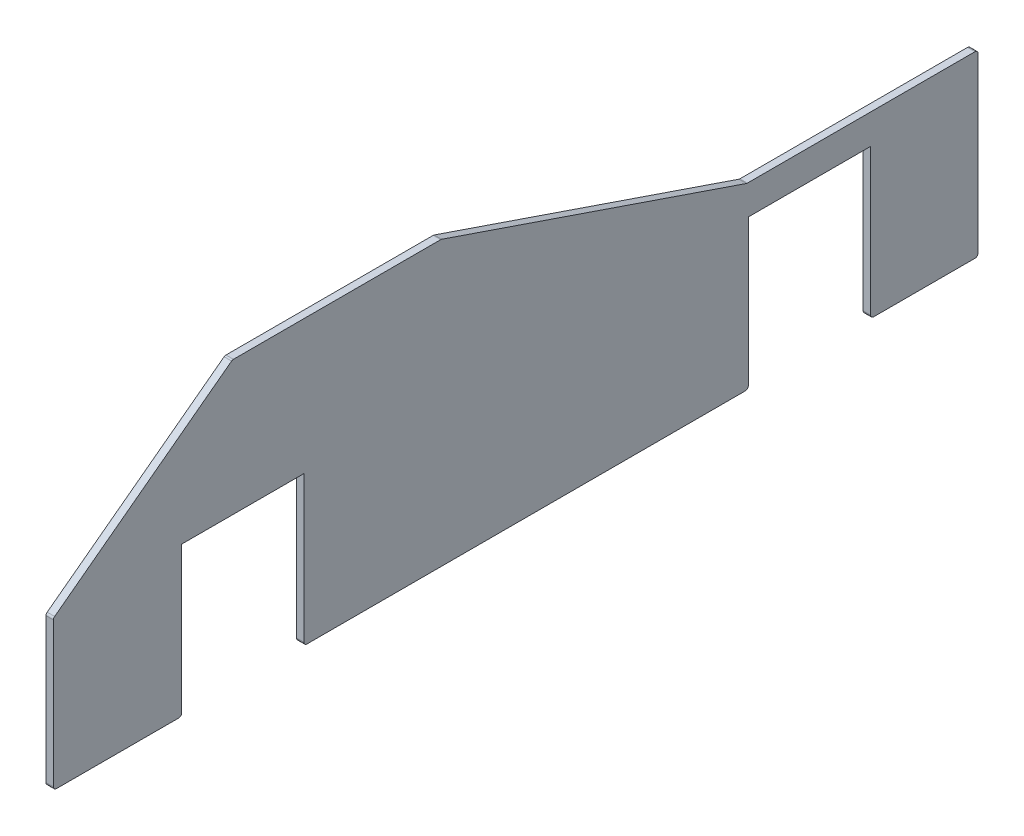
ISO-10303-21;
HEADER;
FILE_DESCRIPTION(('STEP AP214'),'2;1');
FILE_NAME('part.step','',(''),(''),'','','');
FILE_SCHEMA(('AUTOMOTIVE_DESIGN { 1 0 10303 214 1 1 1 1 }'));
ENDSEC;
DATA;
#1=APPLICATION_CONTEXT('core data for automotive mechanical design processes');
#2=APPLICATION_PROTOCOL_DEFINITION('international standard','automotive_design',2000,#1);
#3=PRODUCT_CONTEXT('',#1,'mechanical');
#4=PRODUCT('Part','Part','',(#3));
#5=PRODUCT_RELATED_PRODUCT_CATEGORY('part','',(#4));
#6=PRODUCT_DEFINITION_FORMATION('','',#4);
#7=PRODUCT_DEFINITION_CONTEXT('part definition',#1,'design');
#8=PRODUCT_DEFINITION('design','',#6,#7);
#9=PRODUCT_DEFINITION_SHAPE('','',#8);
#10=(LENGTH_UNIT() NAMED_UNIT(*) SI_UNIT(.MILLI.,.METRE.));
#11=(NAMED_UNIT(*) PLANE_ANGLE_UNIT() SI_UNIT($,.RADIAN.));
#12=(NAMED_UNIT(*) SI_UNIT($,.STERADIAN.) SOLID_ANGLE_UNIT());
#13=UNCERTAINTY_MEASURE_WITH_UNIT(LENGTH_MEASURE(1.E-05),#10,'distance_accuracy_value','');
#14=(GEOMETRIC_REPRESENTATION_CONTEXT(3) GLOBAL_UNCERTAINTY_ASSIGNED_CONTEXT((#13)) GLOBAL_UNIT_ASSIGNED_CONTEXT((#10,
#11,#12)) REPRESENTATION_CONTEXT('',''));
#15=CARTESIAN_POINT('',(0.,0.,0.));
#16=DIRECTION('',(0.,0.,1.));
#17=DIRECTION('',(1.,0.,0.));
#18=AXIS2_PLACEMENT_3D('',#15,#16,#17);
#19=CARTESIAN_POINT('',(5.,-95.,310.));
#20=DIRECTION('',(0.,1.,0.));
#21=DIRECTION('',(0.,0.,1.));
#22=AXIS2_PLACEMENT_3D('',#19,#20,#21);
#23=PLANE('',#22);
#24=DIRECTION('',(0.,0.,-1.));
#25=VECTOR('',#24,1.);
#26=CARTESIAN_POINT('',(5.,-95.,310.));
#27=LINE('',#26,#25);
#28=CARTESIAN_POINT('',(5.,-95.,308.));
#29=VERTEX_POINT('',#28);
#30=CARTESIAN_POINT('',(5.,-95.,226.));
#31=VERTEX_POINT('',#30);
#32=EDGE_CURVE('E293',#29,#31,#27,.T.);
#33=ORIENTED_EDGE('',*,*,#32,.F.);
#34=DIRECTION('',(-1.,0.,0.));
#35=VECTOR('',#34,1.);
#36=CARTESIAN_POINT('',(5.,-95.,308.));
#37=LINE('',#36,#35);
#38=CARTESIAN_POINT('',(0.,-95.,308.));
#39=VERTEX_POINT('',#38);
#40=EDGE_CURVE('E366',#29,#39,#37,.T.);
#41=ORIENTED_EDGE('',*,*,#40,.T.);
#42=DIRECTION('',(0.,0.,-1.));
#43=VECTOR('',#42,1.);
#44=CARTESIAN_POINT('',(0.,-95.,310.));
#45=LINE('',#44,#43);
#46=CARTESIAN_POINT('',(0.,-95.,226.));
#47=VERTEX_POINT('',#46);
#48=EDGE_CURVE('E283',#39,#47,#45,.T.);
#49=ORIENTED_EDGE('',*,*,#48,.T.);
#50=DIRECTION('',(1.,0.,0.));
#51=VECTOR('',#50,1.);
#52=CARTESIAN_POINT('',(5.,-95.,226.));
#53=LINE('',#52,#51);
#54=EDGE_CURVE('E363',#47,#31,#53,.T.);
#55=ORIENTED_EDGE('',*,*,#54,.T.);
#56=EDGE_LOOP('',(#33,#41,#49,#55));
#57=FACE_BOUND('',#56,.T.);
#58=ADVANCED_FACE('F34',(#57),#23,.F.);
#59=CARTESIAN_POINT('',(5.,-95.,140.));
#60=VERTEX_POINT('',#59);
#61=CARTESIAN_POINT('',(5.,-95.,-154.));
#62=VERTEX_POINT('',#61);
#63=EDGE_CURVE('E292',#60,#62,#27,.T.);
#64=ORIENTED_EDGE('',*,*,#63,.F.);
#65=DIRECTION('',(1.,0.,0.));
#66=VECTOR('',#65,1.);
#67=CARTESIAN_POINT('',(5.,-95.,140.));
#68=LINE('',#67,#66);
#69=CARTESIAN_POINT('',(0.,-95.,140.));
#70=VERTEX_POINT('',#69);
#71=EDGE_CURVE('E377',#60,#70,#68,.F.);
#72=ORIENTED_EDGE('',*,*,#71,.T.);
#73=CARTESIAN_POINT('',(0.,-95.,-154.));
#74=VERTEX_POINT('',#73);
#75=EDGE_CURVE('E305',#70,#74,#45,.T.);
#76=ORIENTED_EDGE('',*,*,#75,.T.);
#77=DIRECTION('',(1.,0.,0.));
#78=VECTOR('',#77,1.);
#79=CARTESIAN_POINT('',(5.,-95.,-154.));
#80=LINE('',#79,#78);
#81=EDGE_CURVE('E374',#74,#62,#80,.T.);
#82=ORIENTED_EDGE('',*,*,#81,.T.);
#83=EDGE_LOOP('',(#64,#72,#76,#82));
#84=FACE_BOUND('',#83,.T.);
#85=ADVANCED_FACE('F439',(#84),#23,.F.);
#86=CARTESIAN_POINT('',(5.,0.,0.));
#87=DIRECTION('',(-1.,0.,0.));
#88=DIRECTION('',(0.,0.,1.));
#89=AXIS2_PLACEMENT_3D('',#86,#87,#88);
#90=PLANE('',#89);
#91=DIRECTION('',(0.,-0.32314385329151,-0.946349856067995));
#92=VECTOR('',#91,1.);
#93=CARTESIAN_POINT('',(5.,69.789557805008,-23.8305807139052));
#94=LINE('',#93,#92);
#95=CARTESIAN_POINT('',(5.,94.892699712136,49.685763442684));
#96=VERTEX_POINT('',#95);
#97=CARTESIAN_POINT('',(5.,25.107300287864,-154.685763442684));
#98=VERTEX_POINT('',#97);
#99=EDGE_CURVE('E251',#96,#98,#94,.T.);
#100=ORIENTED_EDGE('',*,*,#99,.F.);
#101=CARTESIAN_POINT('',(5.,93.,50.332051149267));
#102=DIRECTION('',(-1.,0.,0.));
#103=DIRECTION('',(0.,0.,1.));
#104=AXIS2_PLACEMENT_3D('',#101,#102,#103);
#105=CIRCLE('',#104,2.);
#106=CARTESIAN_POINT('',(5.,95.,50.332051149267));
#107=VERTEX_POINT('',#106);
#108=EDGE_CURVE('E329',#96,#107,#105,.F.);
#109=ORIENTED_EDGE('',*,*,#108,.T.);
#110=DIRECTION('',(0.,0.,1.));
#111=VECTOR('',#110,1.);
#112=CARTESIAN_POINT('',(5.,95.,310.));
#113=LINE('',#112,#111);
#114=CARTESIAN_POINT('',(5.,95.,189.333333333333));
#115=VERTEX_POINT('',#114);
#116=EDGE_CURVE('E282',#107,#115,#113,.T.);
#117=ORIENTED_EDGE('',*,*,#116,.T.);
#118=CARTESIAN_POINT('',(5.,93.,189.333333333333));
#119=DIRECTION('',(-1.,0.,0.));
#120=DIRECTION('',(0.,0.,1.));
#121=AXIS2_PLACEMENT_3D('',#118,#119,#120);
#122=CIRCLE('',#121,2.);
#123=CARTESIAN_POINT('',(5.,94.6,190.533333333333));
#124=VERTEX_POINT('',#123);
#125=EDGE_CURVE('E311',#115,#124,#122,.F.);
#126=ORIENTED_EDGE('',*,*,#125,.T.);
#127=DIRECTION('',(0.,0.6,-0.8));
#128=VECTOR('',#127,1.);
#129=CARTESIAN_POINT('',(5.,152.,114.));
#130=LINE('',#129,#128);
#131=CARTESIAN_POINT('',(5.,5.60000000000008,309.2));
#132=VERTEX_POINT('',#131);
#133=EDGE_CURVE('E250',#132,#124,#130,.T.);
#134=ORIENTED_EDGE('',*,*,#133,.F.);
#135=CARTESIAN_POINT('',(5.,4.00000000000006,308.));
#136=DIRECTION('',(-1.,0.,0.));
#137=DIRECTION('',(0.,0.,1.));
#138=AXIS2_PLACEMENT_3D('',#135,#136,#137);
#139=CIRCLE('',#138,2.);
#140=CARTESIAN_POINT('',(5.,4.00000000000006,310.));
#141=VERTEX_POINT('',#140);
#142=EDGE_CURVE('E327',#132,#141,#139,.F.);
#143=ORIENTED_EDGE('',*,*,#142,.T.);
#144=DIRECTION('',(0.,-1.,0.));
#145=VECTOR('',#144,1.);
#146=CARTESIAN_POINT('',(5.,-95.,310.));
#147=LINE('',#146,#145);
#148=CARTESIAN_POINT('',(5.,-93.,310.));
#149=VERTEX_POINT('',#148);
#150=EDGE_CURVE('E286',#141,#149,#147,.T.);
#151=ORIENTED_EDGE('',*,*,#150,.T.);
#152=CARTESIAN_POINT('',(5.,-93.,308.));
#153=DIRECTION('',(-1.,0.,0.));
#154=DIRECTION('',(0.,0.,1.));
#155=AXIS2_PLACEMENT_3D('',#152,#153,#154);
#156=CIRCLE('',#155,2.);
#157=EDGE_CURVE('E325',#149,#29,#156,.F.);
#158=ORIENTED_EDGE('',*,*,#157,.T.);
#159=ORIENTED_EDGE('',*,*,#32,.T.);
#160=CARTESIAN_POINT('',(5.,-93.,226.));
#161=DIRECTION('',(-1.,0.,0.));
#162=DIRECTION('',(0.,0.,1.));
#163=AXIS2_PLACEMENT_3D('',#160,#161,#162);
#164=CIRCLE('',#163,2.);
#165=CARTESIAN_POINT('',(5.,-93.,224.));
#166=VERTEX_POINT('',#165);
#167=EDGE_CURVE('E323',#31,#166,#164,.F.);
#168=ORIENTED_EDGE('',*,*,#167,.T.);
#169=DIRECTION('',(0.,1.,0.));
#170=VECTOR('',#169,1.);
#171=CARTESIAN_POINT('',(5.,0.,224.));
#172=LINE('',#171,#170);
#173=CARTESIAN_POINT('',(5.,5.00000000000003,224.));
#174=VERTEX_POINT('',#173);
#175=EDGE_CURVE('E260',#166,#174,#172,.T.);
#176=ORIENTED_EDGE('',*,*,#175,.T.);
#177=DIRECTION('',(0.,0.,-1.));
#178=VECTOR('',#177,1.);
#179=CARTESIAN_POINT('',(5.,5.00000000000003,0.));
#180=LINE('',#179,#178);
#181=CARTESIAN_POINT('',(5.,5.00000000000003,142.));
#182=VERTEX_POINT('',#181);
#183=EDGE_CURVE('E267',#174,#182,#180,.T.);
#184=ORIENTED_EDGE('',*,*,#183,.T.);
#185=DIRECTION('',(0.,1.,0.));
#186=VECTOR('',#185,1.);
#187=CARTESIAN_POINT('',(5.,0.,142.));
#188=LINE('',#187,#186);
#189=CARTESIAN_POINT('',(5.,-93.,142.));
#190=VERTEX_POINT('',#189);
#191=EDGE_CURVE('E227',#190,#182,#188,.T.);
#192=ORIENTED_EDGE('',*,*,#191,.F.);
#193=CARTESIAN_POINT('',(5.,-93.,140.));
#194=DIRECTION('',(-1.,0.,0.));
#195=DIRECTION('',(0.,0.,1.));
#196=AXIS2_PLACEMENT_3D('',#193,#194,#195);
#197=CIRCLE('',#196,2.);
#198=EDGE_CURVE('E321',#190,#60,#197,.F.);
#199=ORIENTED_EDGE('',*,*,#198,.T.);
#200=ORIENTED_EDGE('',*,*,#63,.T.);
#201=CARTESIAN_POINT('',(5.,-93.,-154.));
#202=DIRECTION('',(-1.,0.,0.));
#203=DIRECTION('',(0.,0.,1.));
#204=AXIS2_PLACEMENT_3D('',#201,#202,#203);
#205=CIRCLE('',#204,2.);
#206=CARTESIAN_POINT('',(5.,-93.,-156.));
#207=VERTEX_POINT('',#206);
#208=EDGE_CURVE('E319',#62,#207,#205,.F.);
#209=ORIENTED_EDGE('',*,*,#208,.T.);
#210=DIRECTION('',(0.,1.,0.));
#211=VECTOR('',#210,1.);
#212=CARTESIAN_POINT('',(5.,0.,-156.));
#213=LINE('',#212,#211);
#214=CARTESIAN_POINT('',(5.,5.00000000000003,-156.));
#215=VERTEX_POINT('',#214);
#216=EDGE_CURVE('E235',#207,#215,#213,.T.);
#217=ORIENTED_EDGE('',*,*,#216,.T.);
#218=DIRECTION('',(0.,0.,-1.));
#219=VECTOR('',#218,1.);
#220=CARTESIAN_POINT('',(5.,5.00000000000003,0.));
#221=LINE('',#220,#219);
#222=CARTESIAN_POINT('',(5.,5.00000000000003,-238.));
#223=VERTEX_POINT('',#222);
#224=EDGE_CURVE('E226',#215,#223,#221,.T.);
#225=ORIENTED_EDGE('',*,*,#224,.T.);
#226=DIRECTION('',(0.,1.,0.));
#227=VECTOR('',#226,1.);
#228=CARTESIAN_POINT('',(5.,0.,-238.));
#229=LINE('',#228,#227);
#230=CARTESIAN_POINT('',(5.,-93.,-238.));
#231=VERTEX_POINT('',#230);
#232=EDGE_CURVE('E238',#231,#223,#229,.T.);
#233=ORIENTED_EDGE('',*,*,#232,.F.);
#234=CARTESIAN_POINT('',(5.,-93.,-240.));
#235=DIRECTION('',(-1.,0.,0.));
#236=DIRECTION('',(0.,0.,1.));
#237=AXIS2_PLACEMENT_3D('',#234,#235,#236);
#238=CIRCLE('',#237,2.);
#239=CARTESIAN_POINT('',(5.,-95.,-240.));
#240=VERTEX_POINT('',#239);
#241=EDGE_CURVE('E317',#231,#240,#238,.F.);
#242=ORIENTED_EDGE('',*,*,#241,.T.);
#243=CARTESIAN_POINT('',(5.,-95.,-308.));
#244=VERTEX_POINT('',#243);
#245=EDGE_CURVE('E289',#240,#244,#27,.T.);
#246=ORIENTED_EDGE('',*,*,#245,.T.);
#247=CARTESIAN_POINT('',(5.,-93.,-308.));
#248=DIRECTION('',(-1.,0.,0.));
#249=DIRECTION('',(0.,0.,1.));
#250=AXIS2_PLACEMENT_3D('',#247,#248,#249);
#251=CIRCLE('',#250,2.);
#252=CARTESIAN_POINT('',(5.,-93.,-310.));
#253=VERTEX_POINT('',#252);
#254=EDGE_CURVE('E315',#244,#253,#251,.F.);
#255=ORIENTED_EDGE('',*,*,#254,.T.);
#256=DIRECTION('',(0.,1.,0.));
#257=VECTOR('',#256,1.);
#258=CARTESIAN_POINT('',(5.,-95.,-310.));
#259=LINE('',#258,#257);
#260=CARTESIAN_POINT('',(5.,23.,-310.));
#261=VERTEX_POINT('',#260);
#262=EDGE_CURVE('E279',#253,#261,#259,.T.);
#263=ORIENTED_EDGE('',*,*,#262,.T.);
#264=CARTESIAN_POINT('',(5.,23.,-308.));
#265=DIRECTION('',(-1.,0.,0.));
#266=DIRECTION('',(0.,0.,1.));
#267=AXIS2_PLACEMENT_3D('',#264,#265,#266);
#268=CIRCLE('',#267,2.);
#269=CARTESIAN_POINT('',(5.,25.,-308.));
#270=VERTEX_POINT('',#269);
#271=EDGE_CURVE('E313',#261,#270,#268,.F.);
#272=ORIENTED_EDGE('',*,*,#271,.T.);
#273=DIRECTION('',(0.,0.,-1.));
#274=VECTOR('',#273,1.);
#275=CARTESIAN_POINT('',(5.,25.,0.));
#276=LINE('',#275,#274);
#277=CARTESIAN_POINT('',(5.,25.,-155.332051149267));
#278=VERTEX_POINT('',#277);
#279=EDGE_CURVE('E247',#278,#270,#276,.T.);
#280=ORIENTED_EDGE('',*,*,#279,.F.);
#281=CARTESIAN_POINT('',(5.,27.,-155.332051149267));
#282=DIRECTION('',(-1.,0.,0.));
#283=DIRECTION('',(0.,0.,1.));
#284=AXIS2_PLACEMENT_3D('',#281,#282,#283);
#285=CIRCLE('',#284,2.);
#286=EDGE_CURVE('E42',#278,#98,#285,.T.);
#287=ORIENTED_EDGE('',*,*,#286,.T.);
#288=EDGE_LOOP('',(#100,#109,#117,#126,#134,#143,#151,#158,#159,#168,#176,#184,#192,#199,#200,
#209,#217,#225,#233,#242,#246,#255,#263,#272,#280,#287));
#289=FACE_BOUND('',#288,.T.);
#290=ADVANCED_FACE('F400',(#289),#90,.F.);
#291=CARTESIAN_POINT('',(0.,0.,0.));
#292=DIRECTION('',(-1.,0.,0.));
#293=DIRECTION('',(0.,0.,1.));
#294=AXIS2_PLACEMENT_3D('',#291,#292,#293);
#295=PLANE('',#294);
#296=DIRECTION('',(0.,0.,1.));
#297=VECTOR('',#296,1.);
#298=CARTESIAN_POINT('',(0.,95.,310.));
#299=LINE('',#298,#297);
#300=CARTESIAN_POINT('',(0.,95.,50.332051149267));
#301=VERTEX_POINT('',#300);
#302=CARTESIAN_POINT('',(0.,95.,189.333333333333));
#303=VERTEX_POINT('',#302);
#304=EDGE_CURVE('E296',#301,#303,#299,.T.);
#305=ORIENTED_EDGE('',*,*,#304,.F.);
#306=CARTESIAN_POINT('',(0.,93.,50.332051149267));
#307=DIRECTION('',(-1.,0.,0.));
#308=DIRECTION('',(0.,0.,1.));
#309=AXIS2_PLACEMENT_3D('',#306,#307,#308);
#310=CIRCLE('',#309,2.);
#311=CARTESIAN_POINT('',(0.,94.892699712136,49.685763442684));
#312=VERTEX_POINT('',#311);
#313=EDGE_CURVE('E353',#301,#312,#310,.T.);
#314=ORIENTED_EDGE('',*,*,#313,.T.);
#315=DIRECTION('',(0.,-0.32314385329151,-0.946349856067995));
#316=VECTOR('',#315,1.);
#317=CARTESIAN_POINT('',(0.,69.789557805008,-23.8305807139052));
#318=LINE('',#317,#316);
#319=CARTESIAN_POINT('',(0.,25.107300287864,-154.685763442684));
#320=VERTEX_POINT('',#319);
#321=EDGE_CURVE('E243',#312,#320,#318,.T.);
#322=ORIENTED_EDGE('',*,*,#321,.T.);
#323=CARTESIAN_POINT('',(0.,27.,-155.332051149267));
#324=DIRECTION('',(-1.,0.,0.));
#325=DIRECTION('',(0.,0.,1.));
#326=AXIS2_PLACEMENT_3D('',#323,#324,#325);
#327=CIRCLE('',#326,2.);
#328=CARTESIAN_POINT('',(0.,25.,-155.332051149267));
#329=VERTEX_POINT('',#328);
#330=EDGE_CURVE('E11',#320,#329,#327,.F.);
#331=ORIENTED_EDGE('',*,*,#330,.T.);
#332=DIRECTION('',(0.,0.,-1.));
#333=VECTOR('',#332,1.);
#334=CARTESIAN_POINT('',(0.,25.,0.));
#335=LINE('',#334,#333);
#336=CARTESIAN_POINT('',(0.,25.,-308.));
#337=VERTEX_POINT('',#336);
#338=EDGE_CURVE('E246',#329,#337,#335,.T.);
#339=ORIENTED_EDGE('',*,*,#338,.T.);
#340=CARTESIAN_POINT('',(0.,23.,-308.));
#341=DIRECTION('',(-1.,0.,0.));
#342=DIRECTION('',(0.,0.,1.));
#343=AXIS2_PLACEMENT_3D('',#340,#341,#342);
#344=CIRCLE('',#343,2.);
#345=CARTESIAN_POINT('',(0.,23.,-310.));
#346=VERTEX_POINT('',#345);
#347=EDGE_CURVE('E338',#337,#346,#344,.T.);
#348=ORIENTED_EDGE('',*,*,#347,.T.);
#349=DIRECTION('',(0.,1.,0.));
#350=VECTOR('',#349,1.);
#351=CARTESIAN_POINT('',(0.,-95.,-310.));
#352=LINE('',#351,#350);
#353=CARTESIAN_POINT('',(0.,-93.,-310.));
#354=VERTEX_POINT('',#353);
#355=EDGE_CURVE('E277',#354,#346,#352,.T.);
#356=ORIENTED_EDGE('',*,*,#355,.F.);
#357=CARTESIAN_POINT('',(0.,-93.,-308.));
#358=DIRECTION('',(-1.,0.,0.));
#359=DIRECTION('',(0.,0.,1.));
#360=AXIS2_PLACEMENT_3D('',#357,#358,#359);
#361=CIRCLE('',#360,2.);
#362=CARTESIAN_POINT('',(0.,-95.,-308.));
#363=VERTEX_POINT('',#362);
#364=EDGE_CURVE('E340',#354,#363,#361,.T.);
#365=ORIENTED_EDGE('',*,*,#364,.T.);
#366=CARTESIAN_POINT('',(0.,-95.,-240.));
#367=VERTEX_POINT('',#366);
#368=EDGE_CURVE('E302',#367,#363,#45,.T.);
#369=ORIENTED_EDGE('',*,*,#368,.F.);
#370=CARTESIAN_POINT('',(0.,-93.,-240.));
#371=DIRECTION('',(-1.,0.,0.));
#372=DIRECTION('',(0.,0.,1.));
#373=AXIS2_PLACEMENT_3D('',#370,#371,#372);
#374=CIRCLE('',#373,2.);
#375=CARTESIAN_POINT('',(0.,-93.,-238.));
#376=VERTEX_POINT('',#375);
#377=EDGE_CURVE('E342',#367,#376,#374,.T.);
#378=ORIENTED_EDGE('',*,*,#377,.T.);
#379=DIRECTION('',(0.,1.,0.));
#380=VECTOR('',#379,1.);
#381=CARTESIAN_POINT('',(0.,0.,-238.));
#382=LINE('',#381,#380);
#383=CARTESIAN_POINT('',(0.,5.00000000000003,-238.));
#384=VERTEX_POINT('',#383);
#385=EDGE_CURVE('E232',#376,#384,#382,.T.);
#386=ORIENTED_EDGE('',*,*,#385,.T.);
#387=DIRECTION('',(0.,0.,-1.));
#388=VECTOR('',#387,1.);
#389=CARTESIAN_POINT('',(0.,5.00000000000003,0.));
#390=LINE('',#389,#388);
#391=CARTESIAN_POINT('',(0.,5.00000000000003,-156.));
#392=VERTEX_POINT('',#391);
#393=EDGE_CURVE('E219',#392,#384,#390,.T.);
#394=ORIENTED_EDGE('',*,*,#393,.F.);
#395=DIRECTION('',(0.,1.,0.));
#396=VECTOR('',#395,1.);
#397=CARTESIAN_POINT('',(0.,0.,-156.));
#398=LINE('',#397,#396);
#399=CARTESIAN_POINT('',(0.,-93.,-156.));
#400=VERTEX_POINT('',#399);
#401=EDGE_CURVE('E208',#400,#392,#398,.T.);
#402=ORIENTED_EDGE('',*,*,#401,.F.);
#403=CARTESIAN_POINT('',(0.,-93.,-154.));
#404=DIRECTION('',(-1.,0.,0.));
#405=DIRECTION('',(0.,0.,1.));
#406=AXIS2_PLACEMENT_3D('',#403,#404,#405);
#407=CIRCLE('',#406,2.);
#408=EDGE_CURVE('E344',#400,#74,#407,.T.);
#409=ORIENTED_EDGE('',*,*,#408,.T.);
#410=ORIENTED_EDGE('',*,*,#75,.F.);
#411=CARTESIAN_POINT('',(0.,-93.,140.));
#412=DIRECTION('',(-1.,0.,0.));
#413=DIRECTION('',(0.,0.,1.));
#414=AXIS2_PLACEMENT_3D('',#411,#412,#413);
#415=CIRCLE('',#414,2.);
#416=CARTESIAN_POINT('',(0.,-93.,142.));
#417=VERTEX_POINT('',#416);
#418=EDGE_CURVE('E346',#70,#417,#415,.T.);
#419=ORIENTED_EDGE('',*,*,#418,.T.);
#420=DIRECTION('',(0.,1.,0.));
#421=VECTOR('',#420,1.);
#422=CARTESIAN_POINT('',(0.,0.,142.));
#423=LINE('',#422,#421);
#424=CARTESIAN_POINT('',(0.,5.00000000000003,142.));
#425=VERTEX_POINT('',#424);
#426=EDGE_CURVE('E257',#417,#425,#423,.T.);
#427=ORIENTED_EDGE('',*,*,#426,.T.);
#428=DIRECTION('',(0.,0.,-1.));
#429=VECTOR('',#428,1.);
#430=CARTESIAN_POINT('',(0.,5.00000000000003,0.));
#431=LINE('',#430,#429);
#432=CARTESIAN_POINT('',(0.,5.00000000000003,224.));
#433=VERTEX_POINT('',#432);
#434=EDGE_CURVE('E259',#433,#425,#431,.T.);
#435=ORIENTED_EDGE('',*,*,#434,.F.);
#436=DIRECTION('',(0.,1.,0.));
#437=VECTOR('',#436,1.);
#438=CARTESIAN_POINT('',(0.,0.,224.));
#439=LINE('',#438,#437);
#440=CARTESIAN_POINT('',(0.,-93.,224.));
#441=VERTEX_POINT('',#440);
#442=EDGE_CURVE('E263',#441,#433,#439,.T.);
#443=ORIENTED_EDGE('',*,*,#442,.F.);
#444=CARTESIAN_POINT('',(0.,-93.,226.));
#445=DIRECTION('',(-1.,0.,0.));
#446=DIRECTION('',(0.,0.,1.));
#447=AXIS2_PLACEMENT_3D('',#444,#445,#446);
#448=CIRCLE('',#447,2.);
#449=EDGE_CURVE('E348',#441,#47,#448,.T.);
#450=ORIENTED_EDGE('',*,*,#449,.T.);
#451=ORIENTED_EDGE('',*,*,#48,.F.);
#452=CARTESIAN_POINT('',(0.,-93.,308.));
#453=DIRECTION('',(-1.,0.,0.));
#454=DIRECTION('',(0.,0.,1.));
#455=AXIS2_PLACEMENT_3D('',#452,#453,#454);
#456=CIRCLE('',#455,2.);
#457=CARTESIAN_POINT('',(0.,-93.,310.));
#458=VERTEX_POINT('',#457);
#459=EDGE_CURVE('E350',#39,#458,#456,.T.);
#460=ORIENTED_EDGE('',*,*,#459,.T.);
#461=DIRECTION('',(0.,-1.,0.));
#462=VECTOR('',#461,1.);
#463=CARTESIAN_POINT('',(0.,-95.,310.));
#464=LINE('',#463,#462);
#465=CARTESIAN_POINT('',(0.,4.00000000000006,310.));
#466=VERTEX_POINT('',#465);
#467=EDGE_CURVE('E299',#466,#458,#464,.T.);
#468=ORIENTED_EDGE('',*,*,#467,.F.);
#469=CARTESIAN_POINT('',(0.,4.00000000000006,308.));
#470=DIRECTION('',(-1.,0.,0.));
#471=DIRECTION('',(0.,0.,1.));
#472=AXIS2_PLACEMENT_3D('',#469,#470,#471);
#473=CIRCLE('',#472,2.);
#474=CARTESIAN_POINT('',(0.,5.60000000000008,309.2));
#475=VERTEX_POINT('',#474);
#476=EDGE_CURVE('E56',#466,#475,#473,.T.);
#477=ORIENTED_EDGE('',*,*,#476,.T.);
#478=DIRECTION('',(0.,0.6,-0.8));
#479=VECTOR('',#478,1.);
#480=CARTESIAN_POINT('',(0.,152.,114.));
#481=LINE('',#480,#479);
#482=CARTESIAN_POINT('',(0.,94.6,190.533333333333));
#483=VERTEX_POINT('',#482);
#484=EDGE_CURVE('E275',#475,#483,#481,.T.);
#485=ORIENTED_EDGE('',*,*,#484,.T.);
#486=CARTESIAN_POINT('',(0.,93.,189.333333333333));
#487=DIRECTION('',(-1.,0.,0.));
#488=DIRECTION('',(0.,0.,1.));
#489=AXIS2_PLACEMENT_3D('',#486,#487,#488);
#490=CIRCLE('',#489,2.);
#491=EDGE_CURVE('E336',#483,#303,#490,.T.);
#492=ORIENTED_EDGE('',*,*,#491,.T.);
#493=EDGE_LOOP('',(#305,#314,#322,#331,#339,#348,#356,#365,#369,#378,#386,#394,#402,#409,#410,
#419,#427,#435,#443,#450,#451,#460,#468,#477,#485,#492));
#494=FACE_BOUND('',#493,.T.);
#495=ADVANCED_FACE('F230',(#494),#295,.T.);
#496=CARTESIAN_POINT('',(5.,-95.,-310.));
#497=DIRECTION('',(0.,0.,1.));
#498=DIRECTION('',(1.,0.,0.));
#499=AXIS2_PLACEMENT_3D('',#496,#497,#498);
#500=PLANE('',#499);
#501=ORIENTED_EDGE('',*,*,#262,.F.);
#502=DIRECTION('',(-1.,0.,0.));
#503=VECTOR('',#502,1.);
#504=CARTESIAN_POINT('',(5.,-93.,-310.));
#505=LINE('',#504,#503);
#506=EDGE_CURVE('E390',#253,#354,#505,.T.);
#507=ORIENTED_EDGE('',*,*,#506,.T.);
#508=ORIENTED_EDGE('',*,*,#355,.T.);
#509=DIRECTION('',(1.,0.,0.));
#510=VECTOR('',#509,1.);
#511=CARTESIAN_POINT('',(5.,23.,-310.));
#512=LINE('',#511,#510);
#513=EDGE_CURVE('E387',#346,#261,#512,.T.);
#514=ORIENTED_EDGE('',*,*,#513,.T.);
#515=EDGE_LOOP('',(#501,#507,#508,#514));
#516=FACE_BOUND('',#515,.T.);
#517=ADVANCED_FACE('F421',(#516),#500,.F.);
#518=CARTESIAN_POINT('',(5.,95.,310.));
#519=DIRECTION('',(0.,-1.,0.));
#520=DIRECTION('',(0.,0.,-1.));
#521=AXIS2_PLACEMENT_3D('',#518,#519,#520);
#522=PLANE('',#521);
#523=ORIENTED_EDGE('',*,*,#116,.F.);
#524=DIRECTION('',(1.,0.,0.));
#525=VECTOR('',#524,1.);
#526=CARTESIAN_POINT('',(5.,95.,50.332051149267));
#527=LINE('',#526,#525);
#528=EDGE_CURVE('E334',#107,#301,#527,.F.);
#529=ORIENTED_EDGE('',*,*,#528,.T.);
#530=ORIENTED_EDGE('',*,*,#304,.T.);
#531=DIRECTION('',(1.,0.,0.));
#532=VECTOR('',#531,1.);
#533=CARTESIAN_POINT('',(5.,95.,189.333333333333));
#534=LINE('',#533,#532);
#535=EDGE_CURVE('E331',#303,#115,#534,.T.);
#536=ORIENTED_EDGE('',*,*,#535,.T.);
#537=EDGE_LOOP('',(#523,#529,#530,#536));
#538=FACE_BOUND('',#537,.T.);
#539=ADVANCED_FACE('F471',(#538),#522,.F.);
#540=CARTESIAN_POINT('',(5.,-95.,310.));
#541=DIRECTION('',(0.,0.,-1.));
#542=DIRECTION('',(-1.,0.,0.));
#543=AXIS2_PLACEMENT_3D('',#540,#541,#542);
#544=PLANE('',#543);
#545=ORIENTED_EDGE('',*,*,#150,.F.);
#546=DIRECTION('',(1.,0.,0.));
#547=VECTOR('',#546,1.);
#548=CARTESIAN_POINT('',(5.,4.00000000000006,310.));
#549=LINE('',#548,#547);
#550=EDGE_CURVE('E361',#141,#466,#549,.F.);
#551=ORIENTED_EDGE('',*,*,#550,.T.);
#552=ORIENTED_EDGE('',*,*,#467,.T.);
#553=DIRECTION('',(-1.,0.,0.));
#554=VECTOR('',#553,1.);
#555=CARTESIAN_POINT('',(5.,-93.,310.));
#556=LINE('',#555,#554);
#557=EDGE_CURVE('E359',#458,#149,#556,.F.);
#558=ORIENTED_EDGE('',*,*,#557,.T.);
#559=EDGE_LOOP('',(#545,#551,#552,#558));
#560=FACE_BOUND('',#559,.T.);
#561=ADVANCED_FACE('F459',(#560),#544,.F.);
#562=ORIENTED_EDGE('',*,*,#245,.F.);
#563=DIRECTION('',(1.,0.,0.));
#564=VECTOR('',#563,1.);
#565=CARTESIAN_POINT('',(5.,-95.,-240.));
#566=LINE('',#565,#564);
#567=EDGE_CURVE('E385',#240,#367,#566,.F.);
#568=ORIENTED_EDGE('',*,*,#567,.T.);
#569=ORIENTED_EDGE('',*,*,#368,.T.);
#570=DIRECTION('',(-1.,0.,0.));
#571=VECTOR('',#570,1.);
#572=CARTESIAN_POINT('',(5.,-95.,-308.));
#573=LINE('',#572,#571);
#574=EDGE_CURVE('E383',#363,#244,#573,.F.);
#575=ORIENTED_EDGE('',*,*,#574,.T.);
#576=EDGE_LOOP('',(#562,#568,#569,#575));
#577=FACE_BOUND('',#576,.T.);
#578=ADVANCED_FACE('F432',(#577),#23,.F.);
#579=CARTESIAN_POINT('',(0.,152.,114.));
#580=DIRECTION('',(0.,-0.8,-0.6));
#581=DIRECTION('',(0.,0.6,-0.8));
#582=AXIS2_PLACEMENT_3D('',#579,#580,#581);
#583=PLANE('',#582);
#584=ORIENTED_EDGE('',*,*,#484,.F.);
#585=DIRECTION('',(1.,0.,0.));
#586=VECTOR('',#585,1.);
#587=CARTESIAN_POINT('',(0.,5.60000000000008,309.2));
#588=LINE('',#587,#586);
#589=EDGE_CURVE('E356',#475,#132,#588,.T.);
#590=ORIENTED_EDGE('',*,*,#589,.T.);
#591=ORIENTED_EDGE('',*,*,#133,.T.);
#592=DIRECTION('',(1.,0.,0.));
#593=VECTOR('',#592,1.);
#594=CARTESIAN_POINT('',(0.,94.6,190.533333333333));
#595=LINE('',#594,#593);
#596=EDGE_CURVE('E49',#124,#483,#595,.F.);
#597=ORIENTED_EDGE('',*,*,#596,.T.);
#598=EDGE_LOOP('',(#584,#590,#591,#597));
#599=FACE_BOUND('',#598,.T.);
#600=ADVANCED_FACE('F465',(#599),#583,.F.);
#601=CARTESIAN_POINT('',(0.,0.,-156.));
#602=DIRECTION('',(0.,0.,-1.));
#603=DIRECTION('',(-1.,0.,0.));
#604=AXIS2_PLACEMENT_3D('',#601,#602,#603);
#605=PLANE('',#604);
#606=ORIENTED_EDGE('',*,*,#216,.F.);
#607=DIRECTION('',(1.,0.,0.));
#608=VECTOR('',#607,1.);
#609=CARTESIAN_POINT('',(0.,-93.,-156.));
#610=LINE('',#609,#608);
#611=EDGE_CURVE('E215',#207,#400,#610,.F.);
#612=ORIENTED_EDGE('',*,*,#611,.T.);
#613=ORIENTED_EDGE('',*,*,#401,.T.);
#614=DIRECTION('',(1.,0.,0.));
#615=VECTOR('',#614,1.);
#616=CARTESIAN_POINT('',(0.,5.00000000000003,-156.));
#617=LINE('',#616,#615);
#618=EDGE_CURVE('E212',#392,#215,#617,.T.);
#619=ORIENTED_EDGE('',*,*,#618,.T.);
#620=EDGE_LOOP('',(#606,#612,#613,#619));
#621=FACE_BOUND('',#620,.T.);
#622=ADVANCED_FACE('F211',(#621),#605,.T.);
#623=CARTESIAN_POINT('',(0.,5.00000000000003,0.));
#624=DIRECTION('',(0.,-1.,0.));
#625=DIRECTION('',(0.,0.,-1.));
#626=AXIS2_PLACEMENT_3D('',#623,#624,#625);
#627=PLANE('',#626);
#628=ORIENTED_EDGE('',*,*,#224,.F.);
#629=ORIENTED_EDGE('',*,*,#618,.F.);
#630=ORIENTED_EDGE('',*,*,#393,.T.);
#631=DIRECTION('',(1.,0.,0.));
#632=VECTOR('',#631,1.);
#633=CARTESIAN_POINT('',(0.,5.00000000000003,-238.));
#634=LINE('',#633,#632);
#635=EDGE_CURVE('E218',#384,#223,#634,.T.);
#636=ORIENTED_EDGE('',*,*,#635,.T.);
#637=EDGE_LOOP('',(#628,#629,#630,#636));
#638=FACE_BOUND('',#637,.T.);
#639=ADVANCED_FACE('F223',(#638),#627,.T.);
#640=CARTESIAN_POINT('',(0.,0.,-238.));
#641=DIRECTION('',(0.,0.,-1.));
#642=DIRECTION('',(-1.,0.,0.));
#643=AXIS2_PLACEMENT_3D('',#640,#641,#642);
#644=PLANE('',#643);
#645=ORIENTED_EDGE('',*,*,#385,.F.);
#646=DIRECTION('',(1.,0.,0.));
#647=VECTOR('',#646,1.);
#648=CARTESIAN_POINT('',(0.,-93.,-238.));
#649=LINE('',#648,#647);
#650=EDGE_CURVE('E380',#376,#231,#649,.T.);
#651=ORIENTED_EDGE('',*,*,#650,.T.);
#652=ORIENTED_EDGE('',*,*,#232,.T.);
#653=ORIENTED_EDGE('',*,*,#635,.F.);
#654=EDGE_LOOP('',(#645,#651,#652,#653));
#655=FACE_BOUND('',#654,.T.);
#656=ADVANCED_FACE('F522',(#655),#644,.F.);
#657=CARTESIAN_POINT('',(0.,0.,224.));
#658=DIRECTION('',(0.,0.,-1.));
#659=DIRECTION('',(-1.,0.,0.));
#660=AXIS2_PLACEMENT_3D('',#657,#658,#659);
#661=PLANE('',#660);
#662=ORIENTED_EDGE('',*,*,#175,.F.);
#663=DIRECTION('',(1.,0.,0.));
#664=VECTOR('',#663,1.);
#665=CARTESIAN_POINT('',(0.,-93.,224.));
#666=LINE('',#665,#664);
#667=EDGE_CURVE('E369',#166,#441,#666,.F.);
#668=ORIENTED_EDGE('',*,*,#667,.T.);
#669=ORIENTED_EDGE('',*,*,#442,.T.);
#670=DIRECTION('',(1.,0.,0.));
#671=VECTOR('',#670,1.);
#672=CARTESIAN_POINT('',(0.,5.00000000000003,224.));
#673=LINE('',#672,#671);
#674=EDGE_CURVE('E254',#433,#174,#673,.T.);
#675=ORIENTED_EDGE('',*,*,#674,.T.);
#676=EDGE_LOOP('',(#662,#668,#669,#675));
#677=FACE_BOUND('',#676,.T.);
#678=ADVANCED_FACE('F518',(#677),#661,.T.);
#679=CARTESIAN_POINT('',(0.,5.00000000000003,0.));
#680=DIRECTION('',(0.,-1.,0.));
#681=DIRECTION('',(0.,0.,-1.));
#682=AXIS2_PLACEMENT_3D('',#679,#680,#681);
#683=PLANE('',#682);
#684=ORIENTED_EDGE('',*,*,#183,.F.);
#685=ORIENTED_EDGE('',*,*,#674,.F.);
#686=ORIENTED_EDGE('',*,*,#434,.T.);
#687=DIRECTION('',(1.,0.,0.));
#688=VECTOR('',#687,1.);
#689=CARTESIAN_POINT('',(0.,5.00000000000003,142.));
#690=LINE('',#689,#688);
#691=EDGE_CURVE('E265',#425,#182,#690,.T.);
#692=ORIENTED_EDGE('',*,*,#691,.T.);
#693=EDGE_LOOP('',(#684,#685,#686,#692));
#694=FACE_BOUND('',#693,.T.);
#695=ADVANCED_FACE('F514',(#694),#683,.T.);
#696=CARTESIAN_POINT('',(0.,0.,142.));
#697=DIRECTION('',(0.,0.,-1.));
#698=DIRECTION('',(-1.,0.,0.));
#699=AXIS2_PLACEMENT_3D('',#696,#697,#698);
#700=PLANE('',#699);
#701=ORIENTED_EDGE('',*,*,#426,.F.);
#702=DIRECTION('',(1.,0.,0.));
#703=VECTOR('',#702,1.);
#704=CARTESIAN_POINT('',(0.,-93.,142.));
#705=LINE('',#704,#703);
#706=EDGE_CURVE('E371',#417,#190,#705,.T.);
#707=ORIENTED_EDGE('',*,*,#706,.T.);
#708=ORIENTED_EDGE('',*,*,#191,.T.);
#709=ORIENTED_EDGE('',*,*,#691,.F.);
#710=EDGE_LOOP('',(#701,#707,#708,#709));
#711=FACE_BOUND('',#710,.T.);
#712=ADVANCED_FACE('F511',(#711),#700,.F.);
#713=CARTESIAN_POINT('',(0.,69.789557805008,-23.8305807139052));
#714=DIRECTION('',(0.,-0.946349856067995,0.32314385329151));
#715=DIRECTION('',(0.,-0.32314385329151,-0.946349856067995));
#716=AXIS2_PLACEMENT_3D('',#713,#714,#715);
#717=PLANE('',#716);
#718=ORIENTED_EDGE('',*,*,#321,.F.);
#719=DIRECTION('',(1.,0.,0.));
#720=VECTOR('',#719,1.);
#721=CARTESIAN_POINT('',(0.,94.892699712136,49.685763442684));
#722=LINE('',#721,#720);
#723=EDGE_CURVE('E308',#312,#96,#722,.T.);
#724=ORIENTED_EDGE('',*,*,#723,.T.);
#725=ORIENTED_EDGE('',*,*,#99,.T.);
#726=DIRECTION('',(1.,0.,0.));
#727=VECTOR('',#726,1.);
#728=CARTESIAN_POINT('',(0.,25.107300287864,-154.685763442684));
#729=LINE('',#728,#727);
#730=EDGE_CURVE('E306',#98,#320,#729,.F.);
#731=ORIENTED_EDGE('',*,*,#730,.T.);
#732=EDGE_LOOP('',(#718,#724,#725,#731));
#733=FACE_BOUND('',#732,.T.);
#734=ADVANCED_FACE('F406',(#733),#717,.F.);
#735=CARTESIAN_POINT('',(0.,25.,0.));
#736=DIRECTION('',(0.,-1.,0.));
#737=DIRECTION('',(0.,0.,-1.));
#738=AXIS2_PLACEMENT_3D('',#735,#736,#737);
#739=PLANE('',#738);
#740=ORIENTED_EDGE('',*,*,#279,.T.);
#741=DIRECTION('',(1.,0.,0.));
#742=VECTOR('',#741,1.);
#743=CARTESIAN_POINT('',(0.,25.,-308.));
#744=LINE('',#743,#742);
#745=EDGE_CURVE('E396',#270,#337,#744,.F.);
#746=ORIENTED_EDGE('',*,*,#745,.T.);
#747=ORIENTED_EDGE('',*,*,#338,.F.);
#748=DIRECTION('',(1.,0.,0.));
#749=VECTOR('',#748,1.);
#750=CARTESIAN_POINT('',(5.,25.,-155.332051149267));
#751=LINE('',#750,#749);
#752=EDGE_CURVE('E393',#329,#278,#751,.T.);
#753=ORIENTED_EDGE('',*,*,#752,.T.);
#754=EDGE_LOOP('',(#740,#746,#747,#753));
#755=FACE_BOUND('',#754,.T.);
#756=ADVANCED_FACE('F413',(#755),#739,.F.);
#757=CARTESIAN_POINT('',(0.,93.,50.332051149267));
#758=DIRECTION('',(1.,0.,0.));
#759=DIRECTION('',(0.,0.,-1.));
#760=AXIS2_PLACEMENT_3D('',#757,#758,#759);
#761=CYLINDRICAL_SURFACE('',#760,2.);
#762=ORIENTED_EDGE('',*,*,#313,.F.);
#763=ORIENTED_EDGE('',*,*,#528,.F.);
#764=ORIENTED_EDGE('',*,*,#108,.F.);
#765=ORIENTED_EDGE('',*,*,#723,.F.);
#766=EDGE_LOOP('',(#762,#763,#764,#765));
#767=FACE_BOUND('',#766,.T.);
#768=ADVANCED_FACE('F475',(#767),#761,.T.);
#769=CARTESIAN_POINT('',(0.,4.00000000000006,308.));
#770=DIRECTION('',(1.,0.,0.));
#771=DIRECTION('',(0.,0.,-1.));
#772=AXIS2_PLACEMENT_3D('',#769,#770,#771);
#773=CYLINDRICAL_SURFACE('',#772,2.);
#774=ORIENTED_EDGE('',*,*,#476,.F.);
#775=ORIENTED_EDGE('',*,*,#550,.F.);
#776=ORIENTED_EDGE('',*,*,#142,.F.);
#777=ORIENTED_EDGE('',*,*,#589,.F.);
#778=EDGE_LOOP('',(#774,#775,#776,#777));
#779=FACE_BOUND('',#778,.T.);
#780=ADVANCED_FACE('F462',(#779),#773,.T.);
#781=CARTESIAN_POINT('',(5.,-93.,308.));
#782=DIRECTION('',(-1.,0.,0.));
#783=DIRECTION('',(0.,0.,1.));
#784=AXIS2_PLACEMENT_3D('',#781,#782,#783);
#785=CYLINDRICAL_SURFACE('',#784,2.);
#786=ORIENTED_EDGE('',*,*,#157,.F.);
#787=ORIENTED_EDGE('',*,*,#557,.F.);
#788=ORIENTED_EDGE('',*,*,#459,.F.);
#789=ORIENTED_EDGE('',*,*,#40,.F.);
#790=EDGE_LOOP('',(#786,#787,#788,#789));
#791=FACE_BOUND('',#790,.T.);
#792=ADVANCED_FACE('F455',(#791),#785,.T.);
#793=CARTESIAN_POINT('',(5.,-93.,226.));
#794=DIRECTION('',(-1.,0.,0.));
#795=DIRECTION('',(0.,0.,1.));
#796=AXIS2_PLACEMENT_3D('',#793,#794,#795);
#797=CYLINDRICAL_SURFACE('',#796,2.);
#798=ORIENTED_EDGE('',*,*,#449,.F.);
#799=ORIENTED_EDGE('',*,*,#667,.F.);
#800=ORIENTED_EDGE('',*,*,#167,.F.);
#801=ORIENTED_EDGE('',*,*,#54,.F.);
#802=EDGE_LOOP('',(#798,#799,#800,#801));
#803=FACE_BOUND('',#802,.T.);
#804=ADVANCED_FACE('F583',(#803),#797,.T.);
#805=CARTESIAN_POINT('',(0.,-93.,140.));
#806=DIRECTION('',(1.,0.,0.));
#807=DIRECTION('',(0.,0.,-1.));
#808=AXIS2_PLACEMENT_3D('',#805,#806,#807);
#809=CYLINDRICAL_SURFACE('',#808,2.);
#810=ORIENTED_EDGE('',*,*,#418,.F.);
#811=ORIENTED_EDGE('',*,*,#71,.F.);
#812=ORIENTED_EDGE('',*,*,#198,.F.);
#813=ORIENTED_EDGE('',*,*,#706,.F.);
#814=EDGE_LOOP('',(#810,#811,#812,#813));
#815=FACE_BOUND('',#814,.T.);
#816=ADVANCED_FACE('F592',(#815),#809,.T.);
#817=CARTESIAN_POINT('',(5.,-93.,-154.));
#818=DIRECTION('',(-1.,0.,0.));
#819=DIRECTION('',(0.,0.,1.));
#820=AXIS2_PLACEMENT_3D('',#817,#818,#819);
#821=CYLINDRICAL_SURFACE('',#820,2.);
#822=ORIENTED_EDGE('',*,*,#408,.F.);
#823=ORIENTED_EDGE('',*,*,#611,.F.);
#824=ORIENTED_EDGE('',*,*,#208,.F.);
#825=ORIENTED_EDGE('',*,*,#81,.F.);
#826=EDGE_LOOP('',(#822,#823,#824,#825));
#827=FACE_BOUND('',#826,.T.);
#828=ADVANCED_FACE('F444',(#827),#821,.T.);
#829=CARTESIAN_POINT('',(0.,-93.,-240.));
#830=DIRECTION('',(1.,0.,0.));
#831=DIRECTION('',(0.,0.,-1.));
#832=AXIS2_PLACEMENT_3D('',#829,#830,#831);
#833=CYLINDRICAL_SURFACE('',#832,2.);
#834=ORIENTED_EDGE('',*,*,#377,.F.);
#835=ORIENTED_EDGE('',*,*,#567,.F.);
#836=ORIENTED_EDGE('',*,*,#241,.F.);
#837=ORIENTED_EDGE('',*,*,#650,.F.);
#838=EDGE_LOOP('',(#834,#835,#836,#837));
#839=FACE_BOUND('',#838,.T.);
#840=ADVANCED_FACE('F611',(#839),#833,.T.);
#841=CARTESIAN_POINT('',(5.,-93.,-308.));
#842=DIRECTION('',(-1.,0.,0.));
#843=DIRECTION('',(0.,0.,1.));
#844=AXIS2_PLACEMENT_3D('',#841,#842,#843);
#845=CYLINDRICAL_SURFACE('',#844,2.);
#846=ORIENTED_EDGE('',*,*,#254,.F.);
#847=ORIENTED_EDGE('',*,*,#574,.F.);
#848=ORIENTED_EDGE('',*,*,#364,.F.);
#849=ORIENTED_EDGE('',*,*,#506,.F.);
#850=EDGE_LOOP('',(#846,#847,#848,#849));
#851=FACE_BOUND('',#850,.T.);
#852=ADVANCED_FACE('F425',(#851),#845,.T.);
#853=CARTESIAN_POINT('',(5.,23.,-308.));
#854=DIRECTION('',(1.,0.,0.));
#855=DIRECTION('',(0.,0.,-1.));
#856=AXIS2_PLACEMENT_3D('',#853,#854,#855);
#857=CYLINDRICAL_SURFACE('',#856,2.);
#858=ORIENTED_EDGE('',*,*,#347,.F.);
#859=ORIENTED_EDGE('',*,*,#745,.F.);
#860=ORIENTED_EDGE('',*,*,#271,.F.);
#861=ORIENTED_EDGE('',*,*,#513,.F.);
#862=EDGE_LOOP('',(#858,#859,#860,#861));
#863=FACE_BOUND('',#862,.T.);
#864=ADVANCED_FACE('F416',(#863),#857,.T.);
#865=CARTESIAN_POINT('',(0.,27.,-155.332051149267));
#866=DIRECTION('',(-1.,0.,0.));
#867=DIRECTION('',(0.,0.,1.));
#868=AXIS2_PLACEMENT_3D('',#865,#866,#867);
#869=CYLINDRICAL_SURFACE('',#868,2.);
#870=ORIENTED_EDGE('',*,*,#330,.F.);
#871=ORIENTED_EDGE('',*,*,#730,.F.);
#872=ORIENTED_EDGE('',*,*,#286,.F.);
#873=ORIENTED_EDGE('',*,*,#752,.F.);
#874=EDGE_LOOP('',(#870,#871,#872,#873));
#875=FACE_BOUND('',#874,.T.);
#876=ADVANCED_FACE('F409',(#875),#869,.F.);
#877=CARTESIAN_POINT('',(5.,93.,189.333333333333));
#878=DIRECTION('',(1.,0.,0.));
#879=DIRECTION('',(0.,0.,-1.));
#880=AXIS2_PLACEMENT_3D('',#877,#878,#879);
#881=CYLINDRICAL_SURFACE('',#880,2.);
#882=ORIENTED_EDGE('',*,*,#491,.F.);
#883=ORIENTED_EDGE('',*,*,#596,.F.);
#884=ORIENTED_EDGE('',*,*,#125,.F.);
#885=ORIENTED_EDGE('',*,*,#535,.F.);
#886=EDGE_LOOP('',(#882,#883,#884,#885));
#887=FACE_BOUND('',#886,.T.);
#888=ADVANCED_FACE('F36',(#887),#881,.T.);
#889=CLOSED_SHELL('',(#58,#85,#290,#495,#517,#539,#561,#578,#600,#622,#639,#656,#678,#695,#712,
#734,#756,#768,#780,#792,#804,#816,#828,#840,#852,#864,#876,#888));
#890=MANIFOLD_SOLID_BREP('B2',#889);
#891=ADVANCED_BREP_SHAPE_REPRESENTATION('',(#18,#890),#14);
#892=SHAPE_DEFINITION_REPRESENTATION(#9,#891);
ENDSEC;
END-ISO-10303-21;
